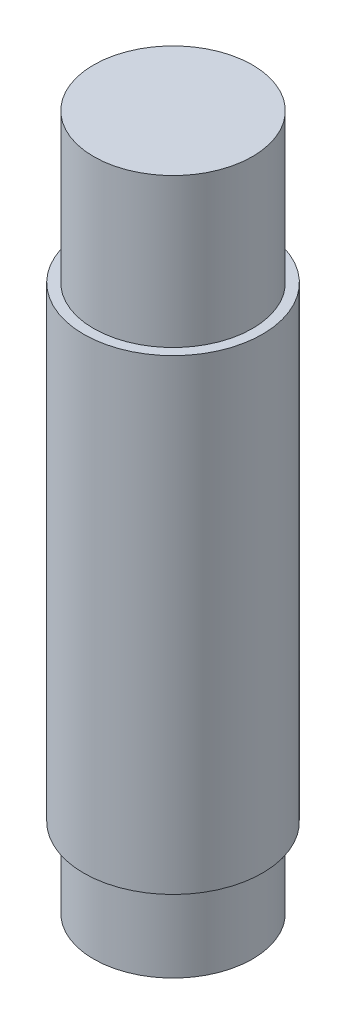
ISO-10303-21;
HEADER;
FILE_DESCRIPTION(('STEP AP214'),'2;1');
FILE_NAME('part.step','',(''),(''),'','','');
FILE_SCHEMA(('AUTOMOTIVE_DESIGN { 1 0 10303 214 1 1 1 1 }'));
ENDSEC;
DATA;
#1=APPLICATION_CONTEXT('core data for automotive mechanical design processes');
#2=APPLICATION_PROTOCOL_DEFINITION('international standard','automotive_design',2000,#1);
#3=PRODUCT_CONTEXT('',#1,'mechanical');
#4=PRODUCT('Part','Part','',(#3));
#5=PRODUCT_RELATED_PRODUCT_CATEGORY('part','',(#4));
#6=PRODUCT_DEFINITION_FORMATION('','',#4);
#7=PRODUCT_DEFINITION_CONTEXT('part definition',#1,'design');
#8=PRODUCT_DEFINITION('design','',#6,#7);
#9=PRODUCT_DEFINITION_SHAPE('','',#8);
#10=(LENGTH_UNIT() NAMED_UNIT(*) SI_UNIT(.MILLI.,.METRE.));
#11=(NAMED_UNIT(*) PLANE_ANGLE_UNIT() SI_UNIT($,.RADIAN.));
#12=(NAMED_UNIT(*) SI_UNIT($,.STERADIAN.) SOLID_ANGLE_UNIT());
#13=UNCERTAINTY_MEASURE_WITH_UNIT(LENGTH_MEASURE(1.E-05),#10,'distance_accuracy_value','');
#14=(GEOMETRIC_REPRESENTATION_CONTEXT(3) GLOBAL_UNCERTAINTY_ASSIGNED_CONTEXT((#13)) GLOBAL_UNIT_ASSIGNED_CONTEXT((#10,
#11,#12)) REPRESENTATION_CONTEXT('',''));
#15=CARTESIAN_POINT('',(0.,0.,0.));
#16=DIRECTION('',(0.,0.,1.));
#17=DIRECTION('',(1.,0.,0.));
#18=AXIS2_PLACEMENT_3D('',#15,#16,#17);
#19=CARTESIAN_POINT('',(0.,55.,0.));
#20=DIRECTION('',(0.,1.,0.));
#21=DIRECTION('',(0.,0.,1.));
#22=AXIS2_PLACEMENT_3D('',#19,#20,#21);
#23=PLANE('',#22);
#24=CARTESIAN_POINT('',(0.,55.,0.));
#25=DIRECTION('',(0.,1.,0.));
#26=DIRECTION('',(0.,0.,1.));
#27=AXIS2_PLACEMENT_3D('',#24,#25,#26);
#28=CIRCLE('',#27,9.);
#29=CARTESIAN_POINT('',(0.,55.,9.));
#30=VERTEX_POINT('',#29);
#31=EDGE_CURVE('E49',#30,#30,#28,.T.);
#32=ORIENTED_EDGE('',*,*,#31,.T.);
#33=EDGE_LOOP('',(#32));
#34=FACE_BOUND('',#33,.T.);
#35=CARTESIAN_POINT('',(0.,55.,0.));
#36=DIRECTION('',(0.,1.,0.));
#37=DIRECTION('',(0.,0.,1.));
#38=AXIS2_PLACEMENT_3D('',#35,#36,#37);
#39=CIRCLE('',#38,8.);
#40=CARTESIAN_POINT('',(0.,55.,8.));
#41=VERTEX_POINT('',#40);
#42=EDGE_CURVE('E59',#41,#41,#39,.T.);
#43=ORIENTED_EDGE('',*,*,#42,.F.);
#44=EDGE_LOOP('',(#43));
#45=FACE_BOUND('',#44,.T.);
#46=ADVANCED_FACE('F34',(#34,#45),#23,.T.);
#47=CARTESIAN_POINT('',(0.,8.,0.));
#48=DIRECTION('',(0.,-1.,0.));
#49=DIRECTION('',(0.,0.,-1.));
#50=AXIS2_PLACEMENT_3D('',#47,#48,#49);
#51=CYLINDRICAL_SURFACE('',#50,8.);
#52=CARTESIAN_POINT('',(0.,8.,0.));
#53=DIRECTION('',(0.,1.,0.));
#54=DIRECTION('',(0.,0.,1.));
#55=AXIS2_PLACEMENT_3D('',#52,#53,#54);
#56=CIRCLE('',#55,8.);
#57=CARTESIAN_POINT('',(0.,8.,8.));
#58=VERTEX_POINT('',#57);
#59=EDGE_CURVE('E10',#58,#58,#56,.T.);
#60=ORIENTED_EDGE('',*,*,#59,.F.);
#61=EDGE_LOOP('',(#60));
#62=FACE_BOUND('',#61,.T.);
#63=CARTESIAN_POINT('',(0.,0.,0.));
#64=DIRECTION('',(0.,1.,0.));
#65=DIRECTION('',(0.,0.,1.));
#66=AXIS2_PLACEMENT_3D('',#63,#64,#65);
#67=CIRCLE('',#66,8.);
#68=CARTESIAN_POINT('',(0.,0.,8.));
#69=VERTEX_POINT('',#68);
#70=EDGE_CURVE('E38',#69,#69,#67,.T.);
#71=ORIENTED_EDGE('',*,*,#70,.T.);
#72=EDGE_LOOP('',(#71));
#73=FACE_BOUND('',#72,.T.);
#74=ADVANCED_FACE('F36',(#62,#73),#51,.T.);
#75=CARTESIAN_POINT('',(0.,0.,0.));
#76=DIRECTION('',(0.,1.,0.));
#77=DIRECTION('',(0.,0.,1.));
#78=AXIS2_PLACEMENT_3D('',#75,#76,#77);
#79=PLANE('',#78);
#80=ORIENTED_EDGE('',*,*,#70,.F.);
#81=EDGE_LOOP('',(#80));
#82=FACE_BOUND('',#81,.T.);
#83=ADVANCED_FACE('F83',(#82),#79,.F.);
#84=CARTESIAN_POINT('',(0.,8.,0.));
#85=DIRECTION('',(0.,1.,0.));
#86=DIRECTION('',(0.,0.,1.));
#87=AXIS2_PLACEMENT_3D('',#84,#85,#86);
#88=PLANE('',#87);
#89=CARTESIAN_POINT('',(0.,8.,0.));
#90=DIRECTION('',(0.,1.,0.));
#91=DIRECTION('',(0.,0.,1.));
#92=AXIS2_PLACEMENT_3D('',#89,#90,#91);
#93=CIRCLE('',#92,9.);
#94=CARTESIAN_POINT('',(0.,8.,9.));
#95=VERTEX_POINT('',#94);
#96=EDGE_CURVE('E51',#95,#95,#93,.T.);
#97=ORIENTED_EDGE('',*,*,#96,.F.);
#98=EDGE_LOOP('',(#97));
#99=FACE_BOUND('',#98,.T.);
#100=ORIENTED_EDGE('',*,*,#59,.T.);
#101=EDGE_LOOP('',(#100));
#102=FACE_BOUND('',#101,.T.);
#103=ADVANCED_FACE('F87',(#99,#102),#88,.F.);
#104=CARTESIAN_POINT('',(0.,55.,0.));
#105=DIRECTION('',(0.,-1.,0.));
#106=DIRECTION('',(0.,0.,-1.));
#107=AXIS2_PLACEMENT_3D('',#104,#105,#106);
#108=CYLINDRICAL_SURFACE('',#107,9.);
#109=ORIENTED_EDGE('',*,*,#31,.F.);
#110=EDGE_LOOP('',(#109));
#111=FACE_BOUND('',#110,.T.);
#112=ORIENTED_EDGE('',*,*,#96,.T.);
#113=EDGE_LOOP('',(#112));
#114=FACE_BOUND('',#113,.T.);
#115=ADVANCED_FACE('F73',(#111,#114),#108,.T.);
#116=CARTESIAN_POINT('',(0.,70.,0.));
#117=DIRECTION('',(0.,-1.,0.));
#118=DIRECTION('',(0.,0.,-1.));
#119=AXIS2_PLACEMENT_3D('',#116,#117,#118);
#120=CYLINDRICAL_SURFACE('',#119,8.);
#121=CARTESIAN_POINT('',(0.,70.,0.));
#122=DIRECTION('',(0.,1.,0.));
#123=DIRECTION('',(0.,0.,1.));
#124=AXIS2_PLACEMENT_3D('',#121,#122,#123);
#125=CIRCLE('',#124,8.);
#126=CARTESIAN_POINT('',(0.,70.,8.));
#127=VERTEX_POINT('',#126);
#128=EDGE_CURVE('E55',#127,#127,#125,.T.);
#129=ORIENTED_EDGE('',*,*,#128,.F.);
#130=EDGE_LOOP('',(#129));
#131=FACE_BOUND('',#130,.T.);
#132=ORIENTED_EDGE('',*,*,#42,.T.);
#133=EDGE_LOOP('',(#132));
#134=FACE_BOUND('',#133,.T.);
#135=ADVANCED_FACE('F70',(#131,#134),#120,.T.);
#136=CARTESIAN_POINT('',(0.,70.,0.));
#137=DIRECTION('',(0.,1.,0.));
#138=DIRECTION('',(0.,0.,1.));
#139=AXIS2_PLACEMENT_3D('',#136,#137,#138);
#140=PLANE('',#139);
#141=ORIENTED_EDGE('',*,*,#128,.T.);
#142=EDGE_LOOP('',(#141));
#143=FACE_BOUND('',#142,.T.);
#144=ADVANCED_FACE('F68',(#143),#140,.T.);
#145=CLOSED_SHELL('',(#46,#74,#83,#103,#115,#135,#144));
#146=MANIFOLD_SOLID_BREP('B2',#145);
#147=ADVANCED_BREP_SHAPE_REPRESENTATION('',(#18,#146),#14);
#148=SHAPE_DEFINITION_REPRESENTATION(#9,#147);
ENDSEC;
END-ISO-10303-21;
